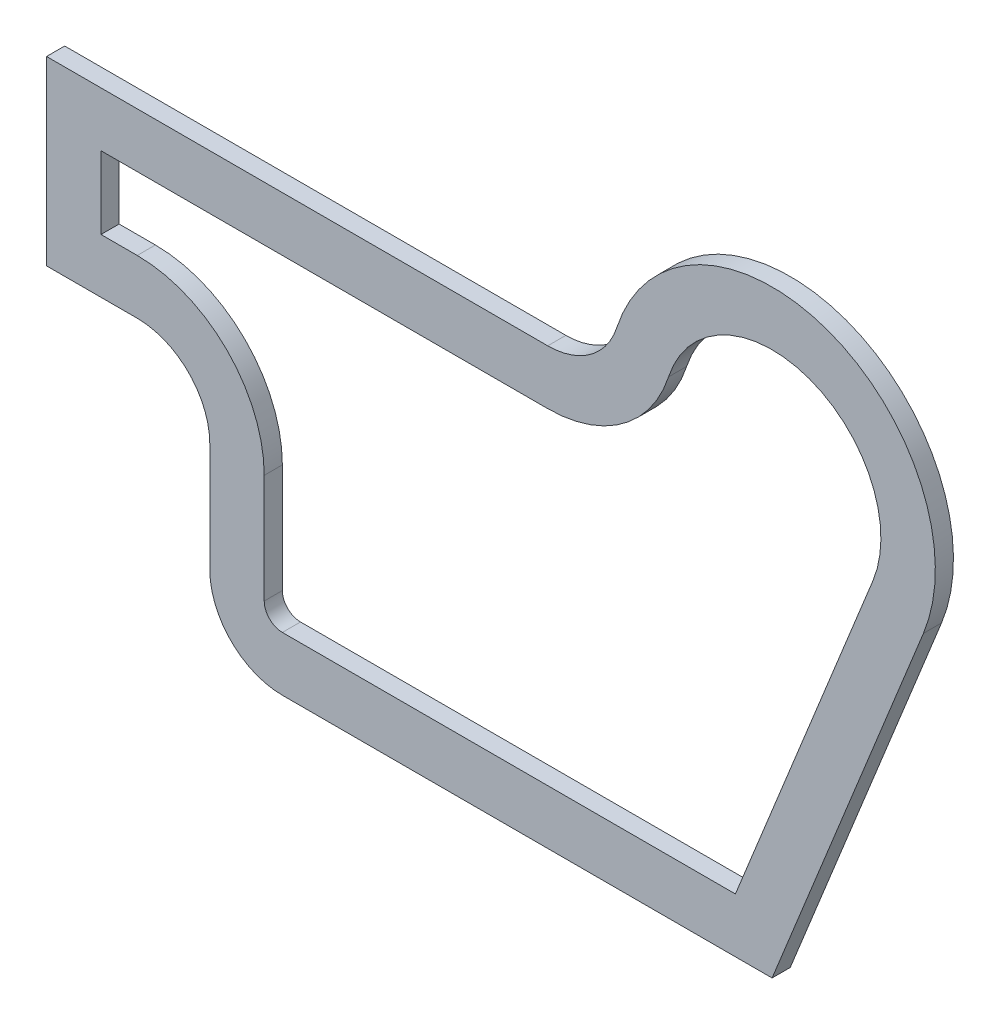
ISO-10303-21;
HEADER;
FILE_DESCRIPTION(('STEP AP214'),'2;1');
FILE_NAME('part.step','',(''),(''),'','','');
FILE_SCHEMA(('AUTOMOTIVE_DESIGN { 1 0 10303 214 1 1 1 1 }'));
ENDSEC;
DATA;
#1=APPLICATION_CONTEXT('core data for automotive mechanical design processes');
#2=APPLICATION_PROTOCOL_DEFINITION('international standard','automotive_design',2000,#1);
#3=PRODUCT_CONTEXT('',#1,'mechanical');
#4=PRODUCT('Part','Part','',(#3));
#5=PRODUCT_RELATED_PRODUCT_CATEGORY('part','',(#4));
#6=PRODUCT_DEFINITION_FORMATION('','',#4);
#7=PRODUCT_DEFINITION_CONTEXT('part definition',#1,'design');
#8=PRODUCT_DEFINITION('design','',#6,#7);
#9=PRODUCT_DEFINITION_SHAPE('','',#8);
#10=(LENGTH_UNIT() NAMED_UNIT(*) SI_UNIT(.MILLI.,.METRE.));
#11=(NAMED_UNIT(*) PLANE_ANGLE_UNIT() SI_UNIT($,.RADIAN.));
#12=(NAMED_UNIT(*) SI_UNIT($,.STERADIAN.) SOLID_ANGLE_UNIT());
#13=UNCERTAINTY_MEASURE_WITH_UNIT(LENGTH_MEASURE(1.E-05),#10,'distance_accuracy_value','');
#14=(GEOMETRIC_REPRESENTATION_CONTEXT(3) GLOBAL_UNCERTAINTY_ASSIGNED_CONTEXT((#13)) GLOBAL_UNIT_ASSIGNED_CONTEXT((#10,
#11,#12)) REPRESENTATION_CONTEXT('',''));
#15=CARTESIAN_POINT('',(0.,0.,0.));
#16=DIRECTION('',(0.,0.,1.));
#17=DIRECTION('',(1.,0.,0.));
#18=AXIS2_PLACEMENT_3D('',#15,#16,#17);
#19=CARTESIAN_POINT('',(0.,0.,0.));
#20=DIRECTION('',(0.,0.,1.));
#21=DIRECTION('',(1.,0.,0.));
#22=AXIS2_PLACEMENT_3D('',#19,#20,#21);
#23=PLANE('',#22);
#24=CARTESIAN_POINT('',(-61.8465843842649,20.,0.));
#25=DIRECTION('',(0.,0.,1.));
#26=DIRECTION('',(1.,0.,0.));
#27=AXIS2_PLACEMENT_3D('',#24,#25,#26);
#28=CIRCLE('',#27,35.);
#29=CARTESIAN_POINT('',(-61.8465843842649,-15.,0.));
#30=VERTEX_POINT('',#29);
#31=CARTESIAN_POINT('',(-28.5445774081223,9.23076923076923,0.));
#32=VERTEX_POINT('',#31);
#33=EDGE_CURVE('E211',#30,#32,#28,.T.);
#34=ORIENTED_EDGE('',*,*,#33,.F.);
#35=DIRECTION('',(-1.,0.,0.));
#36=VECTOR('',#35,1.);
#37=CARTESIAN_POINT('',(-61.8465843842649,-15.,0.));
#38=LINE('',#37,#36);
#39=CARTESIAN_POINT('',(-185.,-15.,0.));
#40=VERTEX_POINT('',#39);
#41=EDGE_CURVE('E205',#30,#40,#38,.T.);
#42=ORIENTED_EDGE('',*,*,#41,.T.);
#43=DIRECTION('',(0.,-1.,0.));
#44=VECTOR('',#43,1.);
#45=CARTESIAN_POINT('',(-185.,-15.,0.));
#46=LINE('',#45,#44);
#47=CARTESIAN_POINT('',(-185.,-35.,0.));
#48=VERTEX_POINT('',#47);
#49=EDGE_CURVE('E214',#40,#48,#46,.T.);
#50=ORIENTED_EDGE('',*,*,#49,.T.);
#51=DIRECTION('',(1.,0.,0.));
#52=VECTOR('',#51,1.);
#53=CARTESIAN_POINT('',(-185.,-35.,0.));
#54=LINE('',#53,#52);
#55=CARTESIAN_POINT('',(-175.,-35.,0.));
#56=VERTEX_POINT('',#55);
#57=EDGE_CURVE('E81',#48,#56,#54,.T.);
#58=ORIENTED_EDGE('',*,*,#57,.T.);
#59=CARTESIAN_POINT('',(-175.,-70.,0.));
#60=DIRECTION('',(0.,0.,1.));
#61=DIRECTION('',(1.,0.,0.));
#62=AXIS2_PLACEMENT_3D('',#59,#60,#61);
#63=CIRCLE('',#62,35.);
#64=CARTESIAN_POINT('',(-140.,-70.,0.));
#65=VERTEX_POINT('',#64);
#66=EDGE_CURVE('E227',#65,#56,#63,.T.);
#67=ORIENTED_EDGE('',*,*,#66,.F.);
#68=DIRECTION('',(0.,-1.,0.));
#69=VECTOR('',#68,1.);
#70=CARTESIAN_POINT('',(-140.,-70.,0.));
#71=LINE('',#70,#69);
#72=CARTESIAN_POINT('',(-140.,-100.,0.));
#73=VERTEX_POINT('',#72);
#74=EDGE_CURVE('E229',#65,#73,#71,.T.);
#75=ORIENTED_EDGE('',*,*,#74,.T.);
#76=CARTESIAN_POINT('',(-135.,-100.,0.));
#77=DIRECTION('',(0.,0.,1.));
#78=DIRECTION('',(1.,0.,0.));
#79=AXIS2_PLACEMENT_3D('',#76,#77,#78);
#80=CIRCLE('',#79,4.99999999999998);
#81=CARTESIAN_POINT('',(-135.,-105.,0.));
#82=VERTEX_POINT('',#81);
#83=EDGE_CURVE('E232',#73,#82,#80,.T.);
#84=ORIENTED_EDGE('',*,*,#83,.T.);
#85=DIRECTION('',(1.,0.,0.));
#86=VECTOR('',#85,1.);
#87=CARTESIAN_POINT('',(-135.,-105.,0.));
#88=LINE('',#87,#86);
#89=CARTESIAN_POINT('',(-10.1129979369486,-105.,0.));
#90=VERTEX_POINT('',#89);
#91=EDGE_CURVE('E235',#82,#90,#88,.T.);
#92=ORIENTED_EDGE('',*,*,#91,.T.);
#93=DIRECTION('',(0.375,0.927024810886958,0.));
#94=VECTOR('',#93,1.);
#95=CARTESIAN_POINT('',(-10.1129979369486,-105.,0.));
#96=LINE('',#95,#94);
#97=CARTESIAN_POINT('',(27.8107443266087,-11.25,0.));
#98=VERTEX_POINT('',#97);
#99=EDGE_CURVE('E238',#90,#98,#96,.T.);
#100=ORIENTED_EDGE('',*,*,#99,.T.);
#101=CARTESIAN_POINT('',(0.,0.,0.));
#102=DIRECTION('',(0.,0.,1.));
#103=DIRECTION('',(1.,0.,0.));
#104=AXIS2_PLACEMENT_3D('',#101,#102,#103);
#105=CIRCLE('',#104,30.);
#106=EDGE_CURVE('E241',#98,#32,#105,.T.);
#107=ORIENTED_EDGE('',*,*,#106,.T.);
#108=EDGE_LOOP('',(#34,#42,#50,#58,#67,#75,#84,#92,#100,#107));
#109=FACE_BOUND('',#108,.T.);
#110=CARTESIAN_POINT('',(-61.8465843842649,20.,0.));
#111=DIRECTION('',(0.,0.,1.));
#112=DIRECTION('',(1.,0.,0.));
#113=AXIS2_PLACEMENT_3D('',#110,#111,#112);
#114=CIRCLE('',#113,20.);
#115=CARTESIAN_POINT('',(-61.8465843842649,0.,0.));
#116=VERTEX_POINT('',#115);
#117=CARTESIAN_POINT('',(-42.8168661121834,13.8461538461539,0.));
#118=VERTEX_POINT('',#117);
#119=EDGE_CURVE('E317',#116,#118,#114,.T.);
#120=ORIENTED_EDGE('',*,*,#119,.T.);
#121=CARTESIAN_POINT('',(0.,0.,0.));
#122=DIRECTION('',(0.,0.,1.));
#123=DIRECTION('',(1.,0.,0.));
#124=AXIS2_PLACEMENT_3D('',#121,#122,#123);
#125=CIRCLE('',#124,45.);
#126=CARTESIAN_POINT('',(41.7161164899131,-16.875,0.));
#127=VERTEX_POINT('',#126);
#128=EDGE_CURVE('E314',#127,#118,#125,.T.);
#129=ORIENTED_EDGE('',*,*,#128,.F.);
#130=DIRECTION('',(-0.375,-0.927024810886958,0.));
#131=VECTOR('',#130,1.);
#132=CARTESIAN_POINT('',(41.7161164899131,-16.875,0.));
#133=LINE('',#132,#131);
#134=CARTESIAN_POINT('',(0.,-120.,0.));
#135=VERTEX_POINT('',#134);
#136=EDGE_CURVE('E269',#127,#135,#133,.T.);
#137=ORIENTED_EDGE('',*,*,#136,.T.);
#138=DIRECTION('',(1.,0.,0.));
#139=VECTOR('',#138,1.);
#140=CARTESIAN_POINT('',(0.,-120.,0.));
#141=LINE('',#140,#139);
#142=CARTESIAN_POINT('',(-135.,-120.,0.));
#143=VERTEX_POINT('',#142);
#144=EDGE_CURVE('E289',#143,#135,#141,.T.);
#145=ORIENTED_EDGE('',*,*,#144,.F.);
#146=CARTESIAN_POINT('',(-135.,-100.,0.));
#147=DIRECTION('',(0.,0.,1.));
#148=DIRECTION('',(1.,0.,0.));
#149=AXIS2_PLACEMENT_3D('',#146,#147,#148);
#150=CIRCLE('',#149,20.);
#151=CARTESIAN_POINT('',(-155.,-100.,0.));
#152=VERTEX_POINT('',#151);
#153=EDGE_CURVE('E333',#152,#143,#150,.T.);
#154=ORIENTED_EDGE('',*,*,#153,.F.);
#155=DIRECTION('',(0.,-1.,0.));
#156=VECTOR('',#155,1.);
#157=CARTESIAN_POINT('',(-155.,0.,0.));
#158=LINE('',#157,#156);
#159=CARTESIAN_POINT('',(-155.,-70.,0.));
#160=VERTEX_POINT('',#159);
#161=EDGE_CURVE('E331',#160,#152,#158,.T.);
#162=ORIENTED_EDGE('',*,*,#161,.F.);
#163=CARTESIAN_POINT('',(-175.,-70.,0.));
#164=DIRECTION('',(0.,0.,1.));
#165=DIRECTION('',(1.,0.,0.));
#166=AXIS2_PLACEMENT_3D('',#163,#164,#165);
#167=CIRCLE('',#166,20.);
#168=CARTESIAN_POINT('',(-175.,-50.,0.));
#169=VERTEX_POINT('',#168);
#170=EDGE_CURVE('E328',#160,#169,#167,.T.);
#171=ORIENTED_EDGE('',*,*,#170,.T.);
#172=DIRECTION('',(1.,0.,0.));
#173=VECTOR('',#172,1.);
#174=CARTESIAN_POINT('',(0.,-50.,0.));
#175=LINE('',#174,#173);
#176=CARTESIAN_POINT('',(-200.,-50.,0.));
#177=VERTEX_POINT('',#176);
#178=EDGE_CURVE('E325',#177,#169,#175,.T.);
#179=ORIENTED_EDGE('',*,*,#178,.F.);
#180=DIRECTION('',(0.,-1.,0.));
#181=VECTOR('',#180,1.);
#182=CARTESIAN_POINT('',(-200.,0.,0.));
#183=LINE('',#182,#181);
#184=CARTESIAN_POINT('',(-200.,0.,0.));
#185=VERTEX_POINT('',#184);
#186=EDGE_CURVE('E323',#185,#177,#183,.T.);
#187=ORIENTED_EDGE('',*,*,#186,.F.);
#188=DIRECTION('',(1.,0.,0.));
#189=VECTOR('',#188,1.);
#190=CARTESIAN_POINT('',(0.,0.,0.));
#191=LINE('',#190,#189);
#192=EDGE_CURVE('E320',#185,#116,#191,.T.);
#193=ORIENTED_EDGE('',*,*,#192,.T.);
#194=EDGE_LOOP('',(#120,#129,#137,#145,#154,#162,#171,#179,#187,#193));
#195=FACE_BOUND('',#194,.T.);
#196=ADVANCED_FACE('F66',(#109,#195),#23,.F.);
#197=CARTESIAN_POINT('',(0.,0.,5.));
#198=DIRECTION('',(0.,0.,-1.));
#199=DIRECTION('',(-1.,0.,0.));
#200=AXIS2_PLACEMENT_3D('',#197,#198,#199);
#201=CYLINDRICAL_SURFACE('',#200,45.);
#202=ORIENTED_EDGE('',*,*,#128,.T.);
#203=DIRECTION('',(0.,0.,-1.));
#204=VECTOR('',#203,1.);
#205=CARTESIAN_POINT('',(-42.8168661121834,13.8461538461539,5.));
#206=LINE('',#205,#204);
#207=CARTESIAN_POINT('',(-42.8168661121834,13.8461538461539,5.));
#208=VERTEX_POINT('',#207);
#209=EDGE_CURVE('E74',#208,#118,#206,.T.);
#210=ORIENTED_EDGE('',*,*,#209,.F.);
#211=CARTESIAN_POINT('',(0.,0.,5.));
#212=DIRECTION('',(0.,0.,1.));
#213=DIRECTION('',(1.,0.,0.));
#214=AXIS2_PLACEMENT_3D('',#211,#212,#213);
#215=CIRCLE('',#214,45.);
#216=CARTESIAN_POINT('',(41.7161164899131,-16.875,5.));
#217=VERTEX_POINT('',#216);
#218=EDGE_CURVE('E288',#217,#208,#215,.T.);
#219=ORIENTED_EDGE('',*,*,#218,.F.);
#220=DIRECTION('',(0.,0.,-1.));
#221=VECTOR('',#220,1.);
#222=CARTESIAN_POINT('',(41.7161164899131,-16.875,5.));
#223=LINE('',#222,#221);
#224=EDGE_CURVE('E12',#217,#127,#223,.T.);
#225=ORIENTED_EDGE('',*,*,#224,.T.);
#226=EDGE_LOOP('',(#202,#210,#219,#225));
#227=FACE_BOUND('',#226,.T.);
#228=ADVANCED_FACE('F361',(#227),#201,.T.);
#229=CARTESIAN_POINT('',(0.,0.,5.));
#230=DIRECTION('',(0.,0.,1.));
#231=DIRECTION('',(1.,0.,0.));
#232=AXIS2_PLACEMENT_3D('',#229,#230,#231);
#233=PLANE('',#232);
#234=DIRECTION('',(-1.,0.,0.));
#235=VECTOR('',#234,1.);
#236=CARTESIAN_POINT('',(-61.8465843842649,-15.,5.));
#237=LINE('',#236,#235);
#238=CARTESIAN_POINT('',(-61.8465843842649,-15.,5.));
#239=VERTEX_POINT('',#238);
#240=CARTESIAN_POINT('',(-185.,-15.,5.));
#241=VERTEX_POINT('',#240);
#242=EDGE_CURVE('E89',#239,#241,#237,.T.);
#243=ORIENTED_EDGE('',*,*,#242,.F.);
#244=CARTESIAN_POINT('',(-61.8465843842649,20.,5.));
#245=DIRECTION('',(0.,0.,1.));
#246=DIRECTION('',(1.,0.,0.));
#247=AXIS2_PLACEMENT_3D('',#244,#245,#246);
#248=CIRCLE('',#247,35.);
#249=CARTESIAN_POINT('',(-28.5445774081223,9.23076923076923,5.));
#250=VERTEX_POINT('',#249);
#251=EDGE_CURVE('E220',#239,#250,#248,.T.);
#252=ORIENTED_EDGE('',*,*,#251,.T.);
#253=CARTESIAN_POINT('',(0.,0.,5.));
#254=DIRECTION('',(0.,0.,1.));
#255=DIRECTION('',(1.,0.,0.));
#256=AXIS2_PLACEMENT_3D('',#253,#254,#255);
#257=CIRCLE('',#256,30.);
#258=CARTESIAN_POINT('',(27.8107443266087,-11.25,5.));
#259=VERTEX_POINT('',#258);
#260=EDGE_CURVE('E223',#259,#250,#257,.T.);
#261=ORIENTED_EDGE('',*,*,#260,.F.);
#262=DIRECTION('',(0.375,0.927024810886958,0.));
#263=VECTOR('',#262,1.);
#264=CARTESIAN_POINT('',(-10.1129979369486,-105.,5.));
#265=LINE('',#264,#263);
#266=CARTESIAN_POINT('',(-10.1129979369486,-105.,5.));
#267=VERTEX_POINT('',#266);
#268=EDGE_CURVE('E262',#267,#259,#265,.T.);
#269=ORIENTED_EDGE('',*,*,#268,.F.);
#270=DIRECTION('',(1.,0.,0.));
#271=VECTOR('',#270,1.);
#272=CARTESIAN_POINT('',(-135.,-105.,5.));
#273=LINE('',#272,#271);
#274=CARTESIAN_POINT('',(-135.,-105.,5.));
#275=VERTEX_POINT('',#274);
#276=EDGE_CURVE('E259',#275,#267,#273,.T.);
#277=ORIENTED_EDGE('',*,*,#276,.F.);
#278=CARTESIAN_POINT('',(-135.,-100.,5.));
#279=DIRECTION('',(0.,0.,1.));
#280=DIRECTION('',(1.,0.,0.));
#281=AXIS2_PLACEMENT_3D('',#278,#279,#280);
#282=CIRCLE('',#281,4.99999999999998);
#283=CARTESIAN_POINT('',(-140.,-100.,5.));
#284=VERTEX_POINT('',#283);
#285=EDGE_CURVE('E256',#284,#275,#282,.T.);
#286=ORIENTED_EDGE('',*,*,#285,.F.);
#287=DIRECTION('',(0.,-1.,0.));
#288=VECTOR('',#287,1.);
#289=CARTESIAN_POINT('',(-140.,-70.,5.));
#290=LINE('',#289,#288);
#291=CARTESIAN_POINT('',(-140.,-70.,5.));
#292=VERTEX_POINT('',#291);
#293=EDGE_CURVE('E253',#292,#284,#290,.T.);
#294=ORIENTED_EDGE('',*,*,#293,.F.);
#295=CARTESIAN_POINT('',(-175.,-70.,5.));
#296=DIRECTION('',(0.,0.,1.));
#297=DIRECTION('',(1.,0.,0.));
#298=AXIS2_PLACEMENT_3D('',#295,#296,#297);
#299=CIRCLE('',#298,35.);
#300=CARTESIAN_POINT('',(-175.,-35.,5.));
#301=VERTEX_POINT('',#300);
#302=EDGE_CURVE('E250',#292,#301,#299,.T.);
#303=ORIENTED_EDGE('',*,*,#302,.T.);
#304=DIRECTION('',(1.,0.,0.));
#305=VECTOR('',#304,1.);
#306=CARTESIAN_POINT('',(-185.,-35.,5.));
#307=LINE('',#306,#305);
#308=CARTESIAN_POINT('',(-185.,-35.,5.));
#309=VERTEX_POINT('',#308);
#310=EDGE_CURVE('E247',#309,#301,#307,.T.);
#311=ORIENTED_EDGE('',*,*,#310,.F.);
#312=DIRECTION('',(0.,-1.,0.));
#313=VECTOR('',#312,1.);
#314=CARTESIAN_POINT('',(-185.,-15.,5.));
#315=LINE('',#314,#313);
#316=EDGE_CURVE('E245',#241,#309,#315,.T.);
#317=ORIENTED_EDGE('',*,*,#316,.F.);
#318=EDGE_LOOP('',(#243,#252,#261,#269,#277,#286,#294,#303,#311,#317));
#319=FACE_BOUND('',#318,.T.);
#320=ORIENTED_EDGE('',*,*,#218,.T.);
#321=CARTESIAN_POINT('',(-61.8465843842649,20.,5.));
#322=DIRECTION('',(0.,0.,1.));
#323=DIRECTION('',(1.,0.,0.));
#324=AXIS2_PLACEMENT_3D('',#321,#322,#323);
#325=CIRCLE('',#324,20.);
#326=CARTESIAN_POINT('',(-61.8465843842649,0.,5.));
#327=VERTEX_POINT('',#326);
#328=EDGE_CURVE('E292',#327,#208,#325,.T.);
#329=ORIENTED_EDGE('',*,*,#328,.F.);
#330=DIRECTION('',(1.,0.,0.));
#331=VECTOR('',#330,1.);
#332=CARTESIAN_POINT('',(0.,0.,5.));
#333=LINE('',#332,#331);
#334=CARTESIAN_POINT('',(-200.,0.,5.));
#335=VERTEX_POINT('',#334);
#336=EDGE_CURVE('E295',#335,#327,#333,.T.);
#337=ORIENTED_EDGE('',*,*,#336,.F.);
#338=DIRECTION('',(0.,-1.,0.));
#339=VECTOR('',#338,1.);
#340=CARTESIAN_POINT('',(-200.,0.,5.));
#341=LINE('',#340,#339);
#342=CARTESIAN_POINT('',(-200.,-50.,5.));
#343=VERTEX_POINT('',#342);
#344=EDGE_CURVE('E298',#335,#343,#341,.T.);
#345=ORIENTED_EDGE('',*,*,#344,.T.);
#346=DIRECTION('',(1.,0.,0.));
#347=VECTOR('',#346,1.);
#348=CARTESIAN_POINT('',(0.,-50.,5.));
#349=LINE('',#348,#347);
#350=CARTESIAN_POINT('',(-175.,-50.,5.));
#351=VERTEX_POINT('',#350);
#352=EDGE_CURVE('E300',#343,#351,#349,.T.);
#353=ORIENTED_EDGE('',*,*,#352,.T.);
#354=CARTESIAN_POINT('',(-175.,-70.,5.));
#355=DIRECTION('',(0.,0.,1.));
#356=DIRECTION('',(1.,0.,0.));
#357=AXIS2_PLACEMENT_3D('',#354,#355,#356);
#358=CIRCLE('',#357,20.);
#359=CARTESIAN_POINT('',(-155.,-70.,5.));
#360=VERTEX_POINT('',#359);
#361=EDGE_CURVE('E302',#360,#351,#358,.T.);
#362=ORIENTED_EDGE('',*,*,#361,.F.);
#363=DIRECTION('',(0.,-1.,0.));
#364=VECTOR('',#363,1.);
#365=CARTESIAN_POINT('',(-155.,0.,5.));
#366=LINE('',#365,#364);
#367=CARTESIAN_POINT('',(-155.,-100.,5.));
#368=VERTEX_POINT('',#367);
#369=EDGE_CURVE('E305',#360,#368,#366,.T.);
#370=ORIENTED_EDGE('',*,*,#369,.T.);
#371=CARTESIAN_POINT('',(-135.,-100.,5.));
#372=DIRECTION('',(0.,0.,1.));
#373=DIRECTION('',(1.,0.,0.));
#374=AXIS2_PLACEMENT_3D('',#371,#372,#373);
#375=CIRCLE('',#374,20.);
#376=CARTESIAN_POINT('',(-135.,-120.,5.));
#377=VERTEX_POINT('',#376);
#378=EDGE_CURVE('E307',#368,#377,#375,.T.);
#379=ORIENTED_EDGE('',*,*,#378,.T.);
#380=DIRECTION('',(1.,0.,0.));
#381=VECTOR('',#380,1.);
#382=CARTESIAN_POINT('',(0.,-120.,5.));
#383=LINE('',#382,#381);
#384=CARTESIAN_POINT('',(0.,-120.,5.));
#385=VERTEX_POINT('',#384);
#386=EDGE_CURVE('E309',#377,#385,#383,.T.);
#387=ORIENTED_EDGE('',*,*,#386,.T.);
#388=DIRECTION('',(-0.375,-0.927024810886958,0.));
#389=VECTOR('',#388,1.);
#390=CARTESIAN_POINT('',(41.7161164899131,-16.875,5.));
#391=LINE('',#390,#389);
#392=EDGE_CURVE('E285',#217,#385,#391,.T.);
#393=ORIENTED_EDGE('',*,*,#392,.F.);
#394=EDGE_LOOP('',(#320,#329,#337,#345,#353,#362,#370,#379,#387,#393));
#395=FACE_BOUND('',#394,.T.);
#396=ADVANCED_FACE('F371',(#319,#395),#233,.T.);
#397=CARTESIAN_POINT('',(-61.8465843842649,20.,5.));
#398=DIRECTION('',(0.,0.,-1.));
#399=DIRECTION('',(-1.,0.,0.));
#400=AXIS2_PLACEMENT_3D('',#397,#398,#399);
#401=CYLINDRICAL_SURFACE('',#400,20.);
#402=ORIENTED_EDGE('',*,*,#119,.F.);
#403=DIRECTION('',(0.,0.,-1.));
#404=VECTOR('',#403,1.);
#405=CARTESIAN_POINT('',(-61.8465843842649,0.,5.));
#406=LINE('',#405,#404);
#407=EDGE_CURVE('E353',#327,#116,#406,.T.);
#408=ORIENTED_EDGE('',*,*,#407,.F.);
#409=ORIENTED_EDGE('',*,*,#328,.T.);
#410=ORIENTED_EDGE('',*,*,#209,.T.);
#411=EDGE_LOOP('',(#402,#408,#409,#410));
#412=FACE_BOUND('',#411,.T.);
#413=ADVANCED_FACE('F356',(#412),#401,.F.);
#414=CARTESIAN_POINT('',(0.,0.,5.));
#415=DIRECTION('',(0.,1.,0.));
#416=DIRECTION('',(0.,0.,1.));
#417=AXIS2_PLACEMENT_3D('',#414,#415,#416);
#418=PLANE('',#417);
#419=ORIENTED_EDGE('',*,*,#192,.F.);
#420=DIRECTION('',(0.,0.,-1.));
#421=VECTOR('',#420,1.);
#422=CARTESIAN_POINT('',(-200.,0.,5.));
#423=LINE('',#422,#421);
#424=EDGE_CURVE('E351',#335,#185,#423,.T.);
#425=ORIENTED_EDGE('',*,*,#424,.F.);
#426=ORIENTED_EDGE('',*,*,#336,.T.);
#427=ORIENTED_EDGE('',*,*,#407,.T.);
#428=EDGE_LOOP('',(#419,#425,#426,#427));
#429=FACE_BOUND('',#428,.T.);
#430=ADVANCED_FACE('F367',(#429),#418,.T.);
#431=CARTESIAN_POINT('',(-200.,0.,5.));
#432=DIRECTION('',(1.,0.,0.));
#433=DIRECTION('',(0.,1.,0.));
#434=AXIS2_PLACEMENT_3D('',#431,#432,#433);
#435=PLANE('',#434);
#436=ORIENTED_EDGE('',*,*,#186,.T.);
#437=DIRECTION('',(0.,0.,-1.));
#438=VECTOR('',#437,1.);
#439=CARTESIAN_POINT('',(-200.,-50.,5.));
#440=LINE('',#439,#438);
#441=EDGE_CURVE('E348',#343,#177,#440,.T.);
#442=ORIENTED_EDGE('',*,*,#441,.F.);
#443=ORIENTED_EDGE('',*,*,#344,.F.);
#444=ORIENTED_EDGE('',*,*,#424,.T.);
#445=EDGE_LOOP('',(#436,#442,#443,#444));
#446=FACE_BOUND('',#445,.T.);
#447=ADVANCED_FACE('F399',(#446),#435,.F.);
#448=CARTESIAN_POINT('',(0.,-50.,5.));
#449=DIRECTION('',(0.,1.,0.));
#450=DIRECTION('',(0.,0.,1.));
#451=AXIS2_PLACEMENT_3D('',#448,#449,#450);
#452=PLANE('',#451);
#453=ORIENTED_EDGE('',*,*,#178,.T.);
#454=DIRECTION('',(0.,0.,-1.));
#455=VECTOR('',#454,1.);
#456=CARTESIAN_POINT('',(-175.,-50.,5.));
#457=LINE('',#456,#455);
#458=EDGE_CURVE('E346',#351,#169,#457,.T.);
#459=ORIENTED_EDGE('',*,*,#458,.F.);
#460=ORIENTED_EDGE('',*,*,#352,.F.);
#461=ORIENTED_EDGE('',*,*,#441,.T.);
#462=EDGE_LOOP('',(#453,#459,#460,#461));
#463=FACE_BOUND('',#462,.T.);
#464=ADVANCED_FACE('F396',(#463),#452,.F.);
#465=CARTESIAN_POINT('',(-175.,-70.,5.));
#466=DIRECTION('',(0.,0.,-1.));
#467=DIRECTION('',(-1.,0.,0.));
#468=AXIS2_PLACEMENT_3D('',#465,#466,#467);
#469=CYLINDRICAL_SURFACE('',#468,20.);
#470=ORIENTED_EDGE('',*,*,#170,.F.);
#471=DIRECTION('',(0.,0.,-1.));
#472=VECTOR('',#471,1.);
#473=CARTESIAN_POINT('',(-155.,-70.,5.));
#474=LINE('',#473,#472);
#475=EDGE_CURVE('E344',#360,#160,#474,.T.);
#476=ORIENTED_EDGE('',*,*,#475,.F.);
#477=ORIENTED_EDGE('',*,*,#361,.T.);
#478=ORIENTED_EDGE('',*,*,#458,.T.);
#479=EDGE_LOOP('',(#470,#476,#477,#478));
#480=FACE_BOUND('',#479,.T.);
#481=ADVANCED_FACE('F392',(#480),#469,.F.);
#482=CARTESIAN_POINT('',(-155.,0.,5.));
#483=DIRECTION('',(1.,0.,0.));
#484=DIRECTION('',(0.,0.,-1.));
#485=AXIS2_PLACEMENT_3D('',#482,#483,#484);
#486=PLANE('',#485);
#487=ORIENTED_EDGE('',*,*,#161,.T.);
#488=DIRECTION('',(0.,0.,-1.));
#489=VECTOR('',#488,1.);
#490=CARTESIAN_POINT('',(-155.,-100.,5.));
#491=LINE('',#490,#489);
#492=EDGE_CURVE('E341',#368,#152,#491,.T.);
#493=ORIENTED_EDGE('',*,*,#492,.F.);
#494=ORIENTED_EDGE('',*,*,#369,.F.);
#495=ORIENTED_EDGE('',*,*,#475,.T.);
#496=EDGE_LOOP('',(#487,#493,#494,#495));
#497=FACE_BOUND('',#496,.T.);
#498=ADVANCED_FACE('F388',(#497),#486,.F.);
#499=CARTESIAN_POINT('',(-135.,-100.,5.));
#500=DIRECTION('',(0.,0.,-1.));
#501=DIRECTION('',(-1.,0.,0.));
#502=AXIS2_PLACEMENT_3D('',#499,#500,#501);
#503=CYLINDRICAL_SURFACE('',#502,20.);
#504=ORIENTED_EDGE('',*,*,#153,.T.);
#505=DIRECTION('',(0.,0.,-1.));
#506=VECTOR('',#505,1.);
#507=CARTESIAN_POINT('',(-135.,-120.,5.));
#508=LINE('',#507,#506);
#509=EDGE_CURVE('E338',#377,#143,#508,.T.);
#510=ORIENTED_EDGE('',*,*,#509,.F.);
#511=ORIENTED_EDGE('',*,*,#378,.F.);
#512=ORIENTED_EDGE('',*,*,#492,.T.);
#513=EDGE_LOOP('',(#504,#510,#511,#512));
#514=FACE_BOUND('',#513,.T.);
#515=ADVANCED_FACE('F384',(#514),#503,.T.);
#516=CARTESIAN_POINT('',(0.,-120.,5.));
#517=DIRECTION('',(0.,1.,0.));
#518=DIRECTION('',(0.,0.,1.));
#519=AXIS2_PLACEMENT_3D('',#516,#517,#518);
#520=PLANE('',#519);
#521=ORIENTED_EDGE('',*,*,#144,.T.);
#522=DIRECTION('',(0.,0.,-1.));
#523=VECTOR('',#522,1.);
#524=CARTESIAN_POINT('',(0.,-120.,5.));
#525=LINE('',#524,#523);
#526=EDGE_CURVE('E311',#385,#135,#525,.T.);
#527=ORIENTED_EDGE('',*,*,#526,.F.);
#528=ORIENTED_EDGE('',*,*,#386,.F.);
#529=ORIENTED_EDGE('',*,*,#509,.T.);
#530=EDGE_LOOP('',(#521,#527,#528,#529));
#531=FACE_BOUND('',#530,.T.);
#532=ADVANCED_FACE('F380',(#531),#520,.F.);
#533=CARTESIAN_POINT('',(41.7161164899131,-16.875,5.));
#534=DIRECTION('',(0.927024810886958,-0.375,0.));
#535=DIRECTION('',(0.375,0.927024810886958,0.));
#536=AXIS2_PLACEMENT_3D('',#533,#534,#535);
#537=PLANE('',#536);
#538=ORIENTED_EDGE('',*,*,#136,.F.);
#539=ORIENTED_EDGE('',*,*,#224,.F.);
#540=ORIENTED_EDGE('',*,*,#392,.T.);
#541=ORIENTED_EDGE('',*,*,#526,.T.);
#542=EDGE_LOOP('',(#538,#539,#540,#541));
#543=FACE_BOUND('',#542,.T.);
#544=ADVANCED_FACE('F68',(#543),#537,.T.);
#545=CARTESIAN_POINT('',(-61.8465843842649,-15.,0.));
#546=DIRECTION('',(0.,1.,0.));
#547=DIRECTION('',(-1.,0.,0.));
#548=AXIS2_PLACEMENT_3D('',#545,#546,#547);
#549=PLANE('',#548);
#550=ORIENTED_EDGE('',*,*,#242,.T.);
#551=DIRECTION('',(0.,0.,1.));
#552=VECTOR('',#551,1.);
#553=CARTESIAN_POINT('',(-185.,-15.,0.));
#554=LINE('',#553,#552);
#555=EDGE_CURVE('E201',#40,#241,#554,.T.);
#556=ORIENTED_EDGE('',*,*,#555,.F.);
#557=ORIENTED_EDGE('',*,*,#41,.F.);
#558=DIRECTION('',(0.,0.,1.));
#559=VECTOR('',#558,1.);
#560=CARTESIAN_POINT('',(-61.8465843842649,-15.,0.));
#561=LINE('',#560,#559);
#562=EDGE_CURVE('E267',#30,#239,#561,.T.);
#563=ORIENTED_EDGE('',*,*,#562,.T.);
#564=EDGE_LOOP('',(#550,#556,#557,#563));
#565=FACE_BOUND('',#564,.T.);
#566=ADVANCED_FACE('F203',(#565),#549,.F.);
#567=CARTESIAN_POINT('',(-61.8465843842649,20.,0.));
#568=DIRECTION('',(0.,0.,1.));
#569=DIRECTION('',(1.,0.,0.));
#570=AXIS2_PLACEMENT_3D('',#567,#568,#569);
#571=CYLINDRICAL_SURFACE('',#570,35.);
#572=ORIENTED_EDGE('',*,*,#251,.F.);
#573=ORIENTED_EDGE('',*,*,#562,.F.);
#574=ORIENTED_EDGE('',*,*,#33,.T.);
#575=DIRECTION('',(0.,0.,1.));
#576=VECTOR('',#575,1.);
#577=CARTESIAN_POINT('',(-28.5445774081223,9.23076923076923,0.));
#578=LINE('',#577,#576);
#579=EDGE_CURVE('E270',#32,#250,#578,.T.);
#580=ORIENTED_EDGE('',*,*,#579,.T.);
#581=EDGE_LOOP('',(#572,#573,#574,#580));
#582=FACE_BOUND('',#581,.T.);
#583=ADVANCED_FACE('F497',(#582),#571,.T.);
#584=CARTESIAN_POINT('',(0.,0.,0.));
#585=DIRECTION('',(0.,0.,1.));
#586=DIRECTION('',(1.,0.,0.));
#587=AXIS2_PLACEMENT_3D('',#584,#585,#586);
#588=CYLINDRICAL_SURFACE('',#587,30.);
#589=ORIENTED_EDGE('',*,*,#260,.T.);
#590=ORIENTED_EDGE('',*,*,#579,.F.);
#591=ORIENTED_EDGE('',*,*,#106,.F.);
#592=DIRECTION('',(0.,0.,1.));
#593=VECTOR('',#592,1.);
#594=CARTESIAN_POINT('',(27.8107443266087,-11.25,0.));
#595=LINE('',#594,#593);
#596=EDGE_CURVE('E272',#98,#259,#595,.T.);
#597=ORIENTED_EDGE('',*,*,#596,.T.);
#598=EDGE_LOOP('',(#589,#590,#591,#597));
#599=FACE_BOUND('',#598,.T.);
#600=ADVANCED_FACE('F506',(#599),#588,.F.);
#601=CARTESIAN_POINT('',(-10.1129979369486,-105.,0.));
#602=DIRECTION('',(0.927024810886958,-0.375,0.));
#603=DIRECTION('',(0.375,0.927024810886958,0.));
#604=AXIS2_PLACEMENT_3D('',#601,#602,#603);
#605=PLANE('',#604);
#606=ORIENTED_EDGE('',*,*,#268,.T.);
#607=ORIENTED_EDGE('',*,*,#596,.F.);
#608=ORIENTED_EDGE('',*,*,#99,.F.);
#609=DIRECTION('',(0.,0.,1.));
#610=VECTOR('',#609,1.);
#611=CARTESIAN_POINT('',(-10.1129979369486,-105.,0.));
#612=LINE('',#611,#610);
#613=EDGE_CURVE('E274',#90,#267,#612,.T.);
#614=ORIENTED_EDGE('',*,*,#613,.T.);
#615=EDGE_LOOP('',(#606,#607,#608,#614));
#616=FACE_BOUND('',#615,.T.);
#617=ADVANCED_FACE('F516',(#616),#605,.F.);
#618=CARTESIAN_POINT('',(-135.,-105.,0.));
#619=DIRECTION('',(0.,-1.,0.));
#620=DIRECTION('',(0.,0.,-1.));
#621=AXIS2_PLACEMENT_3D('',#618,#619,#620);
#622=PLANE('',#621);
#623=ORIENTED_EDGE('',*,*,#276,.T.);
#624=ORIENTED_EDGE('',*,*,#613,.F.);
#625=ORIENTED_EDGE('',*,*,#91,.F.);
#626=DIRECTION('',(0.,0.,1.));
#627=VECTOR('',#626,1.);
#628=CARTESIAN_POINT('',(-135.,-105.,0.));
#629=LINE('',#628,#627);
#630=EDGE_CURVE('E276',#82,#275,#629,.T.);
#631=ORIENTED_EDGE('',*,*,#630,.T.);
#632=EDGE_LOOP('',(#623,#624,#625,#631));
#633=FACE_BOUND('',#632,.T.);
#634=ADVANCED_FACE('F526',(#633),#622,.F.);
#635=CARTESIAN_POINT('',(-135.,-100.,0.));
#636=DIRECTION('',(0.,0.,1.));
#637=DIRECTION('',(1.,0.,0.));
#638=AXIS2_PLACEMENT_3D('',#635,#636,#637);
#639=CYLINDRICAL_SURFACE('',#638,4.99999999999998);
#640=ORIENTED_EDGE('',*,*,#285,.T.);
#641=ORIENTED_EDGE('',*,*,#630,.F.);
#642=ORIENTED_EDGE('',*,*,#83,.F.);
#643=DIRECTION('',(0.,0.,1.));
#644=VECTOR('',#643,1.);
#645=CARTESIAN_POINT('',(-140.,-100.,0.));
#646=LINE('',#645,#644);
#647=EDGE_CURVE('E278',#73,#284,#646,.T.);
#648=ORIENTED_EDGE('',*,*,#647,.T.);
#649=EDGE_LOOP('',(#640,#641,#642,#648));
#650=FACE_BOUND('',#649,.T.);
#651=ADVANCED_FACE('F536',(#650),#639,.F.);
#652=CARTESIAN_POINT('',(-140.,-70.,0.));
#653=DIRECTION('',(-1.,0.,0.));
#654=DIRECTION('',(0.,0.,1.));
#655=AXIS2_PLACEMENT_3D('',#652,#653,#654);
#656=PLANE('',#655);
#657=ORIENTED_EDGE('',*,*,#293,.T.);
#658=ORIENTED_EDGE('',*,*,#647,.F.);
#659=ORIENTED_EDGE('',*,*,#74,.F.);
#660=DIRECTION('',(0.,0.,1.));
#661=VECTOR('',#660,1.);
#662=CARTESIAN_POINT('',(-140.,-70.,0.));
#663=LINE('',#662,#661);
#664=EDGE_CURVE('E280',#65,#292,#663,.T.);
#665=ORIENTED_EDGE('',*,*,#664,.T.);
#666=EDGE_LOOP('',(#657,#658,#659,#665));
#667=FACE_BOUND('',#666,.T.);
#668=ADVANCED_FACE('F546',(#667),#656,.F.);
#669=CARTESIAN_POINT('',(-175.,-70.,0.));
#670=DIRECTION('',(0.,0.,1.));
#671=DIRECTION('',(1.,0.,0.));
#672=AXIS2_PLACEMENT_3D('',#669,#670,#671);
#673=CYLINDRICAL_SURFACE('',#672,35.);
#674=ORIENTED_EDGE('',*,*,#302,.F.);
#675=ORIENTED_EDGE('',*,*,#664,.F.);
#676=ORIENTED_EDGE('',*,*,#66,.T.);
#677=DIRECTION('',(0.,0.,1.));
#678=VECTOR('',#677,1.);
#679=CARTESIAN_POINT('',(-175.,-35.,0.));
#680=LINE('',#679,#678);
#681=EDGE_CURVE('E282',#56,#301,#680,.T.);
#682=ORIENTED_EDGE('',*,*,#681,.T.);
#683=EDGE_LOOP('',(#674,#675,#676,#682));
#684=FACE_BOUND('',#683,.T.);
#685=ADVANCED_FACE('F556',(#684),#673,.T.);
#686=CARTESIAN_POINT('',(-185.,-35.,0.));
#687=DIRECTION('',(0.,-1.,0.));
#688=DIRECTION('',(0.,0.,-1.));
#689=AXIS2_PLACEMENT_3D('',#686,#687,#688);
#690=PLANE('',#689);
#691=ORIENTED_EDGE('',*,*,#310,.T.);
#692=ORIENTED_EDGE('',*,*,#681,.F.);
#693=ORIENTED_EDGE('',*,*,#57,.F.);
#694=DIRECTION('',(0.,0.,1.));
#695=VECTOR('',#694,1.);
#696=CARTESIAN_POINT('',(-185.,-35.,0.));
#697=LINE('',#696,#695);
#698=EDGE_CURVE('E210',#48,#309,#697,.T.);
#699=ORIENTED_EDGE('',*,*,#698,.T.);
#700=EDGE_LOOP('',(#691,#692,#693,#699));
#701=FACE_BOUND('',#700,.T.);
#702=ADVANCED_FACE('F566',(#701),#690,.F.);
#703=CARTESIAN_POINT('',(-185.,-15.,0.));
#704=DIRECTION('',(-1.,0.,0.));
#705=DIRECTION('',(0.,0.,1.));
#706=AXIS2_PLACEMENT_3D('',#703,#704,#705);
#707=PLANE('',#706);
#708=ORIENTED_EDGE('',*,*,#316,.T.);
#709=ORIENTED_EDGE('',*,*,#698,.F.);
#710=ORIENTED_EDGE('',*,*,#49,.F.);
#711=ORIENTED_EDGE('',*,*,#555,.T.);
#712=EDGE_LOOP('',(#708,#709,#710,#711));
#713=FACE_BOUND('',#712,.T.);
#714=ADVANCED_FACE('F215',(#713),#707,.F.);
#715=CLOSED_SHELL('',(#196,#228,#396,#413,#430,#447,#464,#481,#498,#515,#532,#544,#566,#583,
#600,#617,#634,#651,#668,#685,#702,#714));
#716=MANIFOLD_SOLID_BREP('B2',#715);
#717=ADVANCED_BREP_SHAPE_REPRESENTATION('',(#18,#716),#14);
#718=SHAPE_DEFINITION_REPRESENTATION(#9,#717);
ENDSEC;
END-ISO-10303-21;
